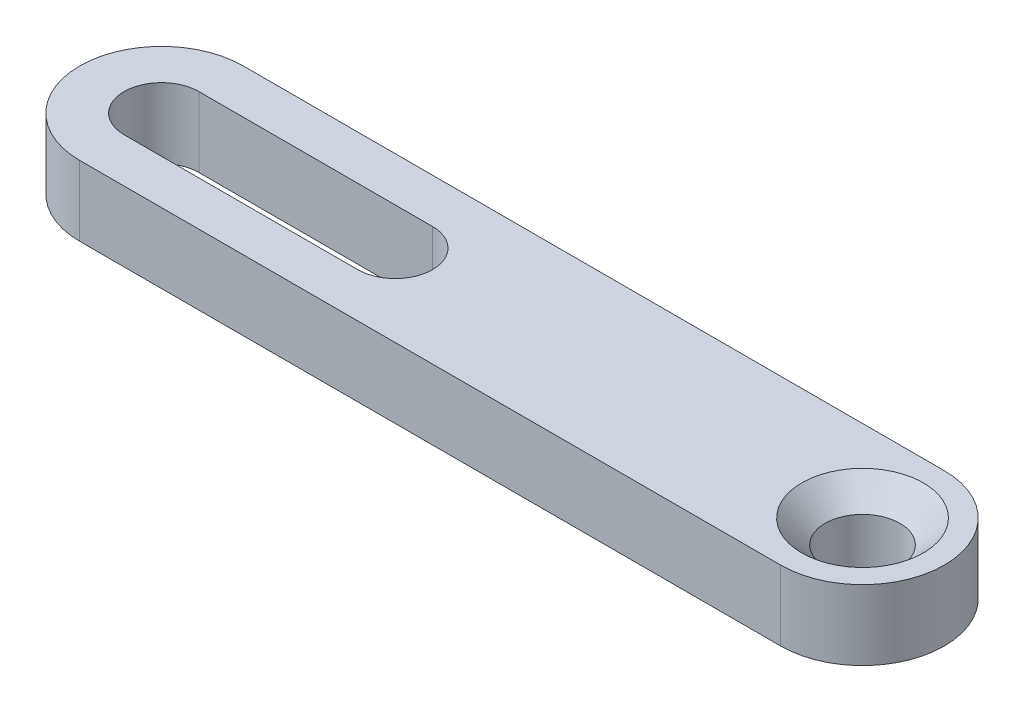
ISO-10303-21;
HEADER;
FILE_DESCRIPTION(('STEP AP214'),'2;1');
FILE_NAME('part.step','',(''),(''),'','','');
FILE_SCHEMA(('AUTOMOTIVE_DESIGN { 1 0 10303 214 1 1 1 1 }'));
ENDSEC;
DATA;
#1=APPLICATION_CONTEXT('core data for automotive mechanical design processes');
#2=APPLICATION_PROTOCOL_DEFINITION('international standard','automotive_design',2000,#1);
#3=PRODUCT_CONTEXT('',#1,'mechanical');
#4=PRODUCT('Part','Part','',(#3));
#5=PRODUCT_RELATED_PRODUCT_CATEGORY('part','',(#4));
#6=PRODUCT_DEFINITION_FORMATION('','',#4);
#7=PRODUCT_DEFINITION_CONTEXT('part definition',#1,'design');
#8=PRODUCT_DEFINITION('design','',#6,#7);
#9=PRODUCT_DEFINITION_SHAPE('','',#8);
#10=(LENGTH_UNIT() NAMED_UNIT(*) SI_UNIT(.MILLI.,.METRE.));
#11=(NAMED_UNIT(*) PLANE_ANGLE_UNIT() SI_UNIT($,.RADIAN.));
#12=(NAMED_UNIT(*) SI_UNIT($,.STERADIAN.) SOLID_ANGLE_UNIT());
#13=UNCERTAINTY_MEASURE_WITH_UNIT(LENGTH_MEASURE(1.E-05),#10,'distance_accuracy_value','');
#14=(GEOMETRIC_REPRESENTATION_CONTEXT(3) GLOBAL_UNCERTAINTY_ASSIGNED_CONTEXT((#13)) GLOBAL_UNIT_ASSIGNED_CONTEXT((#10,
#11,#12)) REPRESENTATION_CONTEXT('',''));
#15=CARTESIAN_POINT('',(0.,0.,0.));
#16=DIRECTION('',(0.,0.,1.));
#17=DIRECTION('',(1.,0.,0.));
#18=AXIS2_PLACEMENT_3D('',#15,#16,#17);
#19=CARTESIAN_POINT('',(-30.,3.,0.));
#20=DIRECTION('',(0.,1.,0.));
#21=DIRECTION('',(0.,0.,1.));
#22=AXIS2_PLACEMENT_3D('',#19,#20,#21);
#23=PLANE('',#22);
#24=CARTESIAN_POINT('',(0.,3.,0.));
#25=DIRECTION('',(0.,1.,0.));
#26=DIRECTION('',(0.,0.,1.));
#27=AXIS2_PLACEMENT_3D('',#24,#25,#26);
#28=CIRCLE('',#27,2.6);
#29=CARTESIAN_POINT('',(0.,3.,2.6));
#30=VERTEX_POINT('',#29);
#31=EDGE_CURVE('E11',#30,#30,#28,.F.);
#32=ORIENTED_EDGE('',*,*,#31,.T.);
#33=EDGE_LOOP('',(#32));
#34=FACE_BOUND('',#33,.T.);
#35=CARTESIAN_POINT('',(-30.,3.,0.));
#36=DIRECTION('',(0.,1.,0.));
#37=DIRECTION('',(0.,0.,1.));
#38=AXIS2_PLACEMENT_3D('',#35,#36,#37);
#39=CIRCLE('',#38,3.5);
#40=CARTESIAN_POINT('',(-30.,3.,-3.5));
#41=VERTEX_POINT('',#40);
#42=CARTESIAN_POINT('',(-30.,3.,3.5));
#43=VERTEX_POINT('',#42);
#44=EDGE_CURVE('E139',#41,#43,#39,.T.);
#45=ORIENTED_EDGE('',*,*,#44,.T.);
#46=DIRECTION('',(1.,0.,0.));
#47=VECTOR('',#46,1.);
#48=CARTESIAN_POINT('',(-30.,3.,3.5));
#49=LINE('',#48,#47);
#50=CARTESIAN_POINT('',(0.,3.,3.5));
#51=VERTEX_POINT('',#50);
#52=EDGE_CURVE('E142',#43,#51,#49,.T.);
#53=ORIENTED_EDGE('',*,*,#52,.T.);
#54=CARTESIAN_POINT('',(0.,3.,0.));
#55=DIRECTION('',(0.,1.,0.));
#56=DIRECTION('',(0.,0.,1.));
#57=AXIS2_PLACEMENT_3D('',#54,#55,#56);
#58=CIRCLE('',#57,3.5);
#59=CARTESIAN_POINT('',(0.,3.,-3.5));
#60=VERTEX_POINT('',#59);
#61=EDGE_CURVE('E145',#51,#60,#58,.T.);
#62=ORIENTED_EDGE('',*,*,#61,.T.);
#63=DIRECTION('',(-1.,0.,0.));
#64=VECTOR('',#63,1.);
#65=CARTESIAN_POINT('',(-30.,3.,-3.5));
#66=LINE('',#65,#64);
#67=EDGE_CURVE('E147',#60,#41,#66,.T.);
#68=ORIENTED_EDGE('',*,*,#67,.T.);
#69=EDGE_LOOP('',(#45,#53,#62,#68));
#70=FACE_BOUND('',#69,.T.);
#71=DIRECTION('',(1.,0.,0.));
#72=VECTOR('',#71,1.);
#73=CARTESIAN_POINT('',(-30.,3.,1.6));
#74=LINE('',#73,#72);
#75=CARTESIAN_POINT('',(-30.,3.,1.6));
#76=VERTEX_POINT('',#75);
#77=CARTESIAN_POINT('',(-20.,3.,1.6));
#78=VERTEX_POINT('',#77);
#79=EDGE_CURVE('E108',#76,#78,#74,.T.);
#80=ORIENTED_EDGE('',*,*,#79,.F.);
#81=CARTESIAN_POINT('',(-30.,3.,0.));
#82=DIRECTION('',(0.,1.,0.));
#83=DIRECTION('',(0.,0.,1.));
#84=AXIS2_PLACEMENT_3D('',#81,#82,#83);
#85=CIRCLE('',#84,1.6);
#86=CARTESIAN_POINT('',(-30.,3.,-1.6));
#87=VERTEX_POINT('',#86);
#88=EDGE_CURVE('E100',#87,#76,#85,.T.);
#89=ORIENTED_EDGE('',*,*,#88,.F.);
#90=DIRECTION('',(-1.,0.,0.));
#91=VECTOR('',#90,1.);
#92=CARTESIAN_POINT('',(-30.,3.,-1.6));
#93=LINE('',#92,#91);
#94=CARTESIAN_POINT('',(-20.,3.,-1.6));
#95=VERTEX_POINT('',#94);
#96=EDGE_CURVE('E122',#95,#87,#93,.T.);
#97=ORIENTED_EDGE('',*,*,#96,.F.);
#98=CARTESIAN_POINT('',(-20.,3.,0.));
#99=DIRECTION('',(0.,1.,0.));
#100=DIRECTION('',(0.,0.,1.));
#101=AXIS2_PLACEMENT_3D('',#98,#99,#100);
#102=CIRCLE('',#101,1.6);
#103=EDGE_CURVE('E120',#78,#95,#102,.T.);
#104=ORIENTED_EDGE('',*,*,#103,.F.);
#105=EDGE_LOOP('',(#80,#89,#97,#104));
#106=FACE_BOUND('',#105,.T.);
#107=ADVANCED_FACE('F35',(#34,#70,#106),#23,.T.);
#108=CARTESIAN_POINT('',(-30.,0.,0.));
#109=DIRECTION('',(0.,1.,0.));
#110=DIRECTION('',(0.,0.,1.));
#111=AXIS2_PLACEMENT_3D('',#108,#109,#110);
#112=PLANE('',#111);
#113=CARTESIAN_POINT('',(0.,0.,0.));
#114=DIRECTION('',(0.,1.,0.));
#115=DIRECTION('',(0.,0.,1.));
#116=AXIS2_PLACEMENT_3D('',#113,#114,#115);
#117=CIRCLE('',#116,1.6);
#118=CARTESIAN_POINT('',(0.,0.,1.6));
#119=VERTEX_POINT('',#118);
#120=EDGE_CURVE('E116',#119,#119,#117,.T.);
#121=ORIENTED_EDGE('',*,*,#120,.T.);
#122=EDGE_LOOP('',(#121));
#123=FACE_BOUND('',#122,.T.);
#124=CARTESIAN_POINT('',(-30.,0.,0.));
#125=DIRECTION('',(0.,1.,0.));
#126=DIRECTION('',(0.,0.,1.));
#127=AXIS2_PLACEMENT_3D('',#124,#125,#126);
#128=CIRCLE('',#127,3.5);
#129=CARTESIAN_POINT('',(-30.,0.,-3.5));
#130=VERTEX_POINT('',#129);
#131=CARTESIAN_POINT('',(-30.,0.,3.5));
#132=VERTEX_POINT('',#131);
#133=EDGE_CURVE('E138',#130,#132,#128,.T.);
#134=ORIENTED_EDGE('',*,*,#133,.F.);
#135=DIRECTION('',(-1.,0.,0.));
#136=VECTOR('',#135,1.);
#137=CARTESIAN_POINT('',(-30.,0.,-3.5));
#138=LINE('',#137,#136);
#139=CARTESIAN_POINT('',(0.,0.,-3.5));
#140=VERTEX_POINT('',#139);
#141=EDGE_CURVE('E143',#140,#130,#138,.T.);
#142=ORIENTED_EDGE('',*,*,#141,.F.);
#143=CARTESIAN_POINT('',(0.,0.,0.));
#144=DIRECTION('',(0.,1.,0.));
#145=DIRECTION('',(0.,0.,1.));
#146=AXIS2_PLACEMENT_3D('',#143,#144,#145);
#147=CIRCLE('',#146,3.5);
#148=CARTESIAN_POINT('',(0.,0.,3.5));
#149=VERTEX_POINT('',#148);
#150=EDGE_CURVE('E154',#149,#140,#147,.T.);
#151=ORIENTED_EDGE('',*,*,#150,.F.);
#152=DIRECTION('',(1.,0.,0.));
#153=VECTOR('',#152,1.);
#154=CARTESIAN_POINT('',(-30.,0.,3.5));
#155=LINE('',#154,#153);
#156=EDGE_CURVE('E152',#132,#149,#155,.T.);
#157=ORIENTED_EDGE('',*,*,#156,.F.);
#158=EDGE_LOOP('',(#134,#142,#151,#157));
#159=FACE_BOUND('',#158,.T.);
#160=CARTESIAN_POINT('',(-30.,0.,0.));
#161=DIRECTION('',(0.,1.,0.));
#162=DIRECTION('',(0.,0.,1.));
#163=AXIS2_PLACEMENT_3D('',#160,#161,#162);
#164=CIRCLE('',#163,1.6);
#165=CARTESIAN_POINT('',(-30.,0.,-1.6));
#166=VERTEX_POINT('',#165);
#167=CARTESIAN_POINT('',(-30.,0.,1.6));
#168=VERTEX_POINT('',#167);
#169=EDGE_CURVE('E58',#166,#168,#164,.T.);
#170=ORIENTED_EDGE('',*,*,#169,.T.);
#171=DIRECTION('',(1.,0.,0.));
#172=VECTOR('',#171,1.);
#173=CARTESIAN_POINT('',(-30.,0.,1.6));
#174=LINE('',#173,#172);
#175=CARTESIAN_POINT('',(-20.,0.,1.6));
#176=VERTEX_POINT('',#175);
#177=EDGE_CURVE('E115',#168,#176,#174,.T.);
#178=ORIENTED_EDGE('',*,*,#177,.T.);
#179=CARTESIAN_POINT('',(-20.,0.,0.));
#180=DIRECTION('',(0.,1.,0.));
#181=DIRECTION('',(0.,0.,1.));
#182=AXIS2_PLACEMENT_3D('',#179,#180,#181);
#183=CIRCLE('',#182,1.6);
#184=CARTESIAN_POINT('',(-20.,0.,-1.6));
#185=VERTEX_POINT('',#184);
#186=EDGE_CURVE('E128',#176,#185,#183,.T.);
#187=ORIENTED_EDGE('',*,*,#186,.T.);
#188=DIRECTION('',(-1.,0.,0.));
#189=VECTOR('',#188,1.);
#190=CARTESIAN_POINT('',(-30.,0.,-1.6));
#191=LINE('',#190,#189);
#192=EDGE_CURVE('E109',#185,#166,#191,.T.);
#193=ORIENTED_EDGE('',*,*,#192,.T.);
#194=EDGE_LOOP('',(#170,#178,#187,#193));
#195=FACE_BOUND('',#194,.T.);
#196=ADVANCED_FACE('F183',(#123,#159,#195),#112,.F.);
#197=CARTESIAN_POINT('',(-30.,3.,0.));
#198=DIRECTION('',(0.,-1.,0.));
#199=DIRECTION('',(0.,0.,-1.));
#200=AXIS2_PLACEMENT_3D('',#197,#198,#199);
#201=CYLINDRICAL_SURFACE('',#200,3.5);
#202=ORIENTED_EDGE('',*,*,#133,.T.);
#203=DIRECTION('',(0.,-1.,0.));
#204=VECTOR('',#203,1.);
#205=CARTESIAN_POINT('',(-30.,3.,3.5));
#206=LINE('',#205,#204);
#207=EDGE_CURVE('E165',#43,#132,#206,.T.);
#208=ORIENTED_EDGE('',*,*,#207,.F.);
#209=ORIENTED_EDGE('',*,*,#44,.F.);
#210=DIRECTION('',(0.,-1.,0.));
#211=VECTOR('',#210,1.);
#212=CARTESIAN_POINT('',(-30.,3.,-3.5));
#213=LINE('',#212,#211);
#214=EDGE_CURVE('E149',#41,#130,#213,.T.);
#215=ORIENTED_EDGE('',*,*,#214,.T.);
#216=EDGE_LOOP('',(#202,#208,#209,#215));
#217=FACE_BOUND('',#216,.T.);
#218=ADVANCED_FACE('F189',(#217),#201,.T.);
#219=CARTESIAN_POINT('',(-30.,3.,3.5));
#220=DIRECTION('',(0.,0.,-1.));
#221=DIRECTION('',(-1.,0.,0.));
#222=AXIS2_PLACEMENT_3D('',#219,#220,#221);
#223=PLANE('',#222);
#224=ORIENTED_EDGE('',*,*,#156,.T.);
#225=DIRECTION('',(0.,-1.,0.));
#226=VECTOR('',#225,1.);
#227=CARTESIAN_POINT('',(0.,3.,3.5));
#228=LINE('',#227,#226);
#229=EDGE_CURVE('E162',#51,#149,#228,.T.);
#230=ORIENTED_EDGE('',*,*,#229,.F.);
#231=ORIENTED_EDGE('',*,*,#52,.F.);
#232=ORIENTED_EDGE('',*,*,#207,.T.);
#233=EDGE_LOOP('',(#224,#230,#231,#232));
#234=FACE_BOUND('',#233,.T.);
#235=ADVANCED_FACE('F203',(#234),#223,.F.);
#236=CARTESIAN_POINT('',(0.,3.,0.));
#237=DIRECTION('',(0.,-1.,0.));
#238=DIRECTION('',(0.,0.,-1.));
#239=AXIS2_PLACEMENT_3D('',#236,#237,#238);
#240=CYLINDRICAL_SURFACE('',#239,3.5);
#241=ORIENTED_EDGE('',*,*,#150,.T.);
#242=DIRECTION('',(0.,-1.,0.));
#243=VECTOR('',#242,1.);
#244=CARTESIAN_POINT('',(0.,3.,-3.5));
#245=LINE('',#244,#243);
#246=EDGE_CURVE('E159',#60,#140,#245,.T.);
#247=ORIENTED_EDGE('',*,*,#246,.F.);
#248=ORIENTED_EDGE('',*,*,#61,.F.);
#249=ORIENTED_EDGE('',*,*,#229,.T.);
#250=EDGE_LOOP('',(#241,#247,#248,#249));
#251=FACE_BOUND('',#250,.T.);
#252=ADVANCED_FACE('F199',(#251),#240,.T.);
#253=CARTESIAN_POINT('',(-30.,3.,-3.5));
#254=DIRECTION('',(0.,0.,1.));
#255=DIRECTION('',(1.,0.,0.));
#256=AXIS2_PLACEMENT_3D('',#253,#254,#255);
#257=PLANE('',#256);
#258=ORIENTED_EDGE('',*,*,#141,.T.);
#259=ORIENTED_EDGE('',*,*,#214,.F.);
#260=ORIENTED_EDGE('',*,*,#67,.F.);
#261=ORIENTED_EDGE('',*,*,#246,.T.);
#262=EDGE_LOOP('',(#258,#259,#260,#261));
#263=FACE_BOUND('',#262,.T.);
#264=ADVANCED_FACE('F196',(#263),#257,.F.);
#265=CARTESIAN_POINT('',(0.,3.,0.));
#266=DIRECTION('',(0.,-1.,0.));
#267=DIRECTION('',(0.,0.,-1.));
#268=AXIS2_PLACEMENT_3D('',#265,#266,#267);
#269=CYLINDRICAL_SURFACE('',#268,1.6);
#270=CARTESIAN_POINT('',(0.,2.,0.));
#271=DIRECTION('',(0.,1.,0.));
#272=DIRECTION('',(0.,0.,1.));
#273=AXIS2_PLACEMENT_3D('',#270,#271,#272);
#274=CIRCLE('',#273,1.6);
#275=CARTESIAN_POINT('',(0.,2.,1.6));
#276=VERTEX_POINT('',#275);
#277=EDGE_CURVE('E43',#276,#276,#274,.T.);
#278=ORIENTED_EDGE('',*,*,#277,.T.);
#279=EDGE_LOOP('',(#278));
#280=FACE_BOUND('',#279,.T.);
#281=ORIENTED_EDGE('',*,*,#120,.F.);
#282=EDGE_LOOP('',(#281));
#283=FACE_BOUND('',#282,.T.);
#284=ADVANCED_FACE('F170',(#280,#283),#269,.F.);
#285=CARTESIAN_POINT('',(-30.,3.,0.));
#286=DIRECTION('',(0.,-1.,0.));
#287=DIRECTION('',(0.,0.,-1.));
#288=AXIS2_PLACEMENT_3D('',#285,#286,#287);
#289=CYLINDRICAL_SURFACE('',#288,1.6);
#290=ORIENTED_EDGE('',*,*,#169,.F.);
#291=DIRECTION('',(0.,-1.,0.));
#292=VECTOR('',#291,1.);
#293=CARTESIAN_POINT('',(-30.,3.,-1.6));
#294=LINE('',#293,#292);
#295=EDGE_CURVE('E104',#87,#166,#294,.T.);
#296=ORIENTED_EDGE('',*,*,#295,.F.);
#297=ORIENTED_EDGE('',*,*,#88,.T.);
#298=DIRECTION('',(0.,-1.,0.));
#299=VECTOR('',#298,1.);
#300=CARTESIAN_POINT('',(-30.,3.,1.6));
#301=LINE('',#300,#299);
#302=EDGE_CURVE('E103',#76,#168,#301,.T.);
#303=ORIENTED_EDGE('',*,*,#302,.T.);
#304=EDGE_LOOP('',(#290,#296,#297,#303));
#305=FACE_BOUND('',#304,.T.);
#306=ADVANCED_FACE('F102',(#305),#289,.F.);
#307=CARTESIAN_POINT('',(-30.,3.,1.6));
#308=DIRECTION('',(0.,0.,-1.));
#309=DIRECTION('',(-1.,0.,0.));
#310=AXIS2_PLACEMENT_3D('',#307,#308,#309);
#311=PLANE('',#310);
#312=ORIENTED_EDGE('',*,*,#177,.F.);
#313=ORIENTED_EDGE('',*,*,#302,.F.);
#314=ORIENTED_EDGE('',*,*,#79,.T.);
#315=DIRECTION('',(0.,-1.,0.));
#316=VECTOR('',#315,1.);
#317=CARTESIAN_POINT('',(-20.,3.,1.6));
#318=LINE('',#317,#316);
#319=EDGE_CURVE('E117',#78,#176,#318,.T.);
#320=ORIENTED_EDGE('',*,*,#319,.T.);
#321=EDGE_LOOP('',(#312,#313,#314,#320));
#322=FACE_BOUND('',#321,.T.);
#323=ADVANCED_FACE('F112',(#322),#311,.T.);
#324=CARTESIAN_POINT('',(-20.,3.,0.));
#325=DIRECTION('',(0.,-1.,0.));
#326=DIRECTION('',(0.,0.,-1.));
#327=AXIS2_PLACEMENT_3D('',#324,#325,#326);
#328=CYLINDRICAL_SURFACE('',#327,1.6);
#329=ORIENTED_EDGE('',*,*,#186,.F.);
#330=ORIENTED_EDGE('',*,*,#319,.F.);
#331=ORIENTED_EDGE('',*,*,#103,.T.);
#332=DIRECTION('',(0.,-1.,0.));
#333=VECTOR('',#332,1.);
#334=CARTESIAN_POINT('',(-20.,3.,-1.6));
#335=LINE('',#334,#333);
#336=EDGE_CURVE('E50',#95,#185,#335,.T.);
#337=ORIENTED_EDGE('',*,*,#336,.T.);
#338=EDGE_LOOP('',(#329,#330,#331,#337));
#339=FACE_BOUND('',#338,.T.);
#340=ADVANCED_FACE('F179',(#339),#328,.F.);
#341=CARTESIAN_POINT('',(-30.,3.,-1.6));
#342=DIRECTION('',(0.,0.,1.));
#343=DIRECTION('',(1.,0.,0.));
#344=AXIS2_PLACEMENT_3D('',#341,#342,#343);
#345=PLANE('',#344);
#346=ORIENTED_EDGE('',*,*,#192,.F.);
#347=ORIENTED_EDGE('',*,*,#336,.F.);
#348=ORIENTED_EDGE('',*,*,#96,.T.);
#349=ORIENTED_EDGE('',*,*,#295,.T.);
#350=EDGE_LOOP('',(#346,#347,#348,#349));
#351=FACE_BOUND('',#350,.T.);
#352=ADVANCED_FACE('F174',(#351),#345,.T.);
#353=CARTESIAN_POINT('',(0.,2.,0.));
#354=DIRECTION('',(0.,1.,0.));
#355=DIRECTION('',(0.,0.,1.));
#356=AXIS2_PLACEMENT_3D('',#353,#354,#355);
#357=CONICAL_SURFACE('',#356,1.6,0.785398163397449);
#358=ORIENTED_EDGE('',*,*,#31,.F.);
#359=EDGE_LOOP('',(#358));
#360=FACE_BOUND('',#359,.T.);
#361=ORIENTED_EDGE('',*,*,#277,.F.);
#362=EDGE_LOOP('',(#361));
#363=FACE_BOUND('',#362,.T.);
#364=ADVANCED_FACE('F37',(#360,#363),#357,.F.);
#365=CLOSED_SHELL('',(#107,#196,#218,#235,#252,#264,#284,#306,#323,#340,#352,#364));
#366=MANIFOLD_SOLID_BREP('B2',#365);
#367=ADVANCED_BREP_SHAPE_REPRESENTATION('',(#18,#366),#14);
#368=SHAPE_DEFINITION_REPRESENTATION(#9,#367);
ENDSEC;
END-ISO-10303-21;
